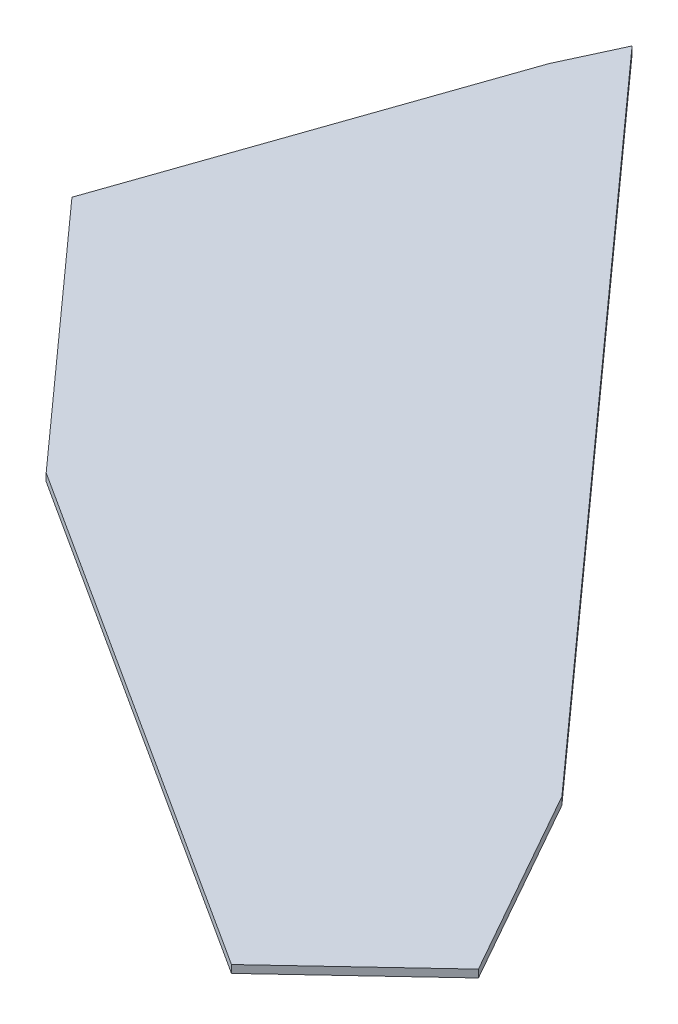
ISO-10303-21;
HEADER;
FILE_DESCRIPTION(('STEP AP214'),'2;1');
FILE_NAME('part.step','',(''),(''),'','','');
FILE_SCHEMA(('AUTOMOTIVE_DESIGN { 1 0 10303 214 1 1 1 1 }'));
ENDSEC;
DATA;
#1=APPLICATION_CONTEXT('core data for automotive mechanical design processes');
#2=APPLICATION_PROTOCOL_DEFINITION('international standard','automotive_design',2000,#1);
#3=PRODUCT_CONTEXT('',#1,'mechanical');
#4=PRODUCT('Part','Part','',(#3));
#5=PRODUCT_RELATED_PRODUCT_CATEGORY('part','',(#4));
#6=PRODUCT_DEFINITION_FORMATION('','',#4);
#7=PRODUCT_DEFINITION_CONTEXT('part definition',#1,'design');
#8=PRODUCT_DEFINITION('design','',#6,#7);
#9=PRODUCT_DEFINITION_SHAPE('','',#8);
#10=(LENGTH_UNIT() NAMED_UNIT(*) SI_UNIT(.MILLI.,.METRE.));
#11=(NAMED_UNIT(*) PLANE_ANGLE_UNIT() SI_UNIT($,.RADIAN.));
#12=(NAMED_UNIT(*) SI_UNIT($,.STERADIAN.) SOLID_ANGLE_UNIT());
#13=UNCERTAINTY_MEASURE_WITH_UNIT(LENGTH_MEASURE(1.E-05),#10,'distance_accuracy_value','');
#14=(GEOMETRIC_REPRESENTATION_CONTEXT(3) GLOBAL_UNCERTAINTY_ASSIGNED_CONTEXT((#13)) GLOBAL_UNIT_ASSIGNED_CONTEXT((#10,
#11,#12)) REPRESENTATION_CONTEXT('',''));
#15=CARTESIAN_POINT('',(0.,0.,0.));
#16=DIRECTION('',(0.,0.,1.));
#17=DIRECTION('',(1.,0.,0.));
#18=AXIS2_PLACEMENT_3D('',#15,#16,#17);
#19=CARTESIAN_POINT('',(-20.0213464052609,2.,-172.579626327256));
#20=DIRECTION('',(0.90792566358203,0.,0.419131231727165));
#21=DIRECTION('',(0.419131231727165,0.,-0.90792566358203));
#22=AXIS2_PLACEMENT_3D('',#19,#20,#21);
#23=PLANE('',#22);
#24=DIRECTION('',(-0.419131231727165,0.,0.90792566358203));
#25=VECTOR('',#24,1.);
#26=CARTESIAN_POINT('',(-20.0213464052609,0.,-172.579626327256));
#27=LINE('',#26,#25);
#28=CARTESIAN_POINT('',(-20.0213464052609,0.,-172.579626327256));
#29=VERTEX_POINT('',#28);
#30=CARTESIAN_POINT('',(-26.8480833342277,0.,-157.791490327964));
#31=VERTEX_POINT('',#30);
#32=EDGE_CURVE('E140',#29,#31,#27,.T.);
#33=ORIENTED_EDGE('',*,*,#32,.T.);
#34=DIRECTION('',(0.,-1.,0.));
#35=VECTOR('',#34,1.);
#36=CARTESIAN_POINT('',(-26.8480833342277,2.,-157.791490327964));
#37=LINE('',#36,#35);
#38=CARTESIAN_POINT('',(-26.8480833342277,2.,-157.791490327964));
#39=VERTEX_POINT('',#38);
#40=EDGE_CURVE('E11',#39,#31,#37,.T.);
#41=ORIENTED_EDGE('',*,*,#40,.F.);
#42=DIRECTION('',(-0.419131231727165,0.,0.90792566358203));
#43=VECTOR('',#42,1.);
#44=CARTESIAN_POINT('',(-20.0213464052609,2.,-172.579626327256));
#45=LINE('',#44,#43);
#46=CARTESIAN_POINT('',(-20.0213464052609,2.,-172.579626327256));
#47=VERTEX_POINT('',#46);
#48=EDGE_CURVE('E162',#47,#39,#45,.T.);
#49=ORIENTED_EDGE('',*,*,#48,.F.);
#50=DIRECTION('',(0.,-1.,0.));
#51=VECTOR('',#50,1.);
#52=CARTESIAN_POINT('',(-20.0213464052609,2.,-172.579626327256));
#53=LINE('',#52,#51);
#54=EDGE_CURVE('E136',#47,#29,#53,.T.);
#55=ORIENTED_EDGE('',*,*,#54,.T.);
#56=EDGE_LOOP('',(#33,#41,#49,#55));
#57=FACE_BOUND('',#56,.T.);
#58=ADVANCED_FACE('F39',(#57),#23,.F.);
#59=CARTESIAN_POINT('',(-26.8480833342277,2.,-157.791490327964));
#60=DIRECTION('',(0.944859691776277,0.,0.327475438554463));
#61=DIRECTION('',(0.327475438554463,0.,-0.944859691776277));
#62=AXIS2_PLACEMENT_3D('',#59,#60,#61);
#63=PLANE('',#62);
#64=DIRECTION('',(-0.327475438554463,0.,0.944859691776277));
#65=VECTOR('',#64,1.);
#66=CARTESIAN_POINT('',(-26.8480833342277,0.,-157.791490327964));
#67=LINE('',#66,#65);
#68=CARTESIAN_POINT('',(-58.8222032614266,0.,-65.5370689503242));
#69=VERTEX_POINT('',#68);
#70=EDGE_CURVE('E144',#31,#69,#67,.T.);
#71=ORIENTED_EDGE('',*,*,#70,.T.);
#72=DIRECTION('',(0.,-1.,0.));
#73=VECTOR('',#72,1.);
#74=CARTESIAN_POINT('',(-58.8222032614266,2.,-65.5370689503242));
#75=LINE('',#74,#73);
#76=CARTESIAN_POINT('',(-58.8222032614266,2.,-65.5370689503242));
#77=VERTEX_POINT('',#76);
#78=EDGE_CURVE('E48',#77,#69,#75,.T.);
#79=ORIENTED_EDGE('',*,*,#78,.F.);
#80=DIRECTION('',(-0.327475438554463,0.,0.944859691776277));
#81=VECTOR('',#80,1.);
#82=CARTESIAN_POINT('',(-26.8480833342277,2.,-157.791490327964));
#83=LINE('',#82,#81);
#84=EDGE_CURVE('E99',#39,#77,#83,.T.);
#85=ORIENTED_EDGE('',*,*,#84,.F.);
#86=ORIENTED_EDGE('',*,*,#40,.T.);
#87=EDGE_LOOP('',(#71,#79,#85,#86));
#88=FACE_BOUND('',#87,.T.);
#89=ADVANCED_FACE('F208',(#88),#63,.F.);
#90=CARTESIAN_POINT('',(-58.8222032614266,2.,-65.5370689503242));
#91=DIRECTION('',(0.744203419196436,0.,-0.667953045397903));
#92=DIRECTION('',(-0.667953045397903,0.,-0.744203419196436));
#93=AXIS2_PLACEMENT_3D('',#90,#91,#92);
#94=PLANE('',#93);
#95=DIRECTION('',(0.667953045397903,0.,0.744203419196436));
#96=VECTOR('',#95,1.);
#97=CARTESIAN_POINT('',(-58.8222032614266,0.,-65.5370689503242));
#98=LINE('',#97,#96);
#99=CARTESIAN_POINT('',(0.,0.,0.));
#100=VERTEX_POINT('',#99);
#101=EDGE_CURVE('E147',#69,#100,#98,.T.);
#102=ORIENTED_EDGE('',*,*,#101,.T.);
#103=DIRECTION('',(0.,-1.,0.));
#104=VECTOR('',#103,1.);
#105=CARTESIAN_POINT('',(0.,2.,0.));
#106=LINE('',#105,#104);
#107=CARTESIAN_POINT('',(0.,2.,0.));
#108=VERTEX_POINT('',#107);
#109=EDGE_CURVE('E173',#108,#100,#106,.T.);
#110=ORIENTED_EDGE('',*,*,#109,.F.);
#111=DIRECTION('',(0.667953045397903,0.,0.744203419196436));
#112=VECTOR('',#111,1.);
#113=CARTESIAN_POINT('',(-58.8222032614266,2.,-65.5370689503242));
#114=LINE('',#113,#112);
#115=EDGE_CURVE('E183',#77,#108,#114,.T.);
#116=ORIENTED_EDGE('',*,*,#115,.F.);
#117=ORIENTED_EDGE('',*,*,#78,.T.);
#118=EDGE_LOOP('',(#102,#110,#116,#117));
#119=FACE_BOUND('',#118,.T.);
#120=ADVANCED_FACE('F181',(#119),#94,.F.);
#121=CARTESIAN_POINT('',(0.,2.,0.));
#122=DIRECTION('',(0.540597226723028,0.,-0.841281545298226));
#123=DIRECTION('',(-0.841281545298226,0.,-0.540597226723028));
#124=AXIS2_PLACEMENT_3D('',#121,#122,#123);
#125=PLANE('',#124);
#126=DIRECTION('',(0.841281545298226,0.,0.540597226723028));
#127=VECTOR('',#126,1.);
#128=CARTESIAN_POINT('',(0.,0.,0.));
#129=LINE('',#128,#127);
#130=CARTESIAN_POINT('',(135.077099652426,0.,86.7988913747134));
#131=VERTEX_POINT('',#130);
#132=EDGE_CURVE('E150',#100,#131,#129,.T.);
#133=ORIENTED_EDGE('',*,*,#132,.T.);
#134=DIRECTION('',(0.,-1.,0.));
#135=VECTOR('',#134,1.);
#136=CARTESIAN_POINT('',(135.077099652426,2.,86.7988913747134));
#137=LINE('',#136,#135);
#138=CARTESIAN_POINT('',(135.077099652426,2.,86.7988913747134));
#139=VERTEX_POINT('',#138);
#140=EDGE_CURVE('E169',#139,#131,#137,.T.);
#141=ORIENTED_EDGE('',*,*,#140,.F.);
#142=DIRECTION('',(0.841281545298226,0.,0.540597226723028));
#143=VECTOR('',#142,1.);
#144=CARTESIAN_POINT('',(0.,2.,0.));
#145=LINE('',#144,#143);
#146=EDGE_CURVE('E196',#108,#139,#145,.T.);
#147=ORIENTED_EDGE('',*,*,#146,.F.);
#148=ORIENTED_EDGE('',*,*,#109,.T.);
#149=EDGE_LOOP('',(#133,#141,#147,#148));
#150=FACE_BOUND('',#149,.T.);
#151=ADVANCED_FACE('F191',(#150),#125,.F.);
#152=CARTESIAN_POINT('',(135.077099652426,2.,86.7988913747134));
#153=DIRECTION('',(-0.683855826593794,0.,-0.729617165665473));
#154=DIRECTION('',(-0.729617165665473,0.,0.683855826593794));
#155=AXIS2_PLACEMENT_3D('',#152,#153,#154);
#156=PLANE('',#155);
#157=DIRECTION('',(0.729617165665473,0.,-0.683855826593794));
#158=VECTOR('',#157,1.);
#159=CARTESIAN_POINT('',(135.077099652426,0.,86.7988913747134));
#160=LINE('',#159,#158);
#161=CARTESIAN_POINT('',(168.284361453358,0.,55.6743776756967));
#162=VERTEX_POINT('',#161);
#163=EDGE_CURVE('E153',#131,#162,#160,.T.);
#164=ORIENTED_EDGE('',*,*,#163,.T.);
#165=DIRECTION('',(0.,-1.,0.));
#166=VECTOR('',#165,1.);
#167=CARTESIAN_POINT('',(168.284361453358,2.,55.6743776756967));
#168=LINE('',#167,#166);
#169=CARTESIAN_POINT('',(168.284361453358,2.,55.6743776756967));
#170=VERTEX_POINT('',#169);
#171=EDGE_CURVE('E129',#170,#162,#168,.T.);
#172=ORIENTED_EDGE('',*,*,#171,.F.);
#173=DIRECTION('',(0.729617165665473,0.,-0.683855826593794));
#174=VECTOR('',#173,1.);
#175=CARTESIAN_POINT('',(135.077099652426,2.,86.7988913747134));
#176=LINE('',#175,#174);
#177=EDGE_CURVE('E118',#139,#170,#176,.T.);
#178=ORIENTED_EDGE('',*,*,#177,.F.);
#179=ORIENTED_EDGE('',*,*,#140,.T.);
#180=EDGE_LOOP('',(#164,#172,#178,#179));
#181=FACE_BOUND('',#180,.T.);
#182=ADVANCED_FACE('F194',(#181),#156,.F.);
#183=CARTESIAN_POINT('',(168.284361453358,2.,55.6743776756967));
#184=DIRECTION('',(-0.871229546829923,0.,0.490875826182679));
#185=DIRECTION('',(0.490875826182679,0.,0.871229546829922));
#186=AXIS2_PLACEMENT_3D('',#183,#184,#185);
#187=PLANE('',#186);
#188=DIRECTION('',(-0.490875826182679,0.,-0.871229546829923));
#189=VECTOR('',#188,1.);
#190=CARTESIAN_POINT('',(168.284361453358,0.,55.6743776756967));
#191=LINE('',#190,#189);
#192=CARTESIAN_POINT('',(140.224514958185,0.,5.8724399102601));
#193=VERTEX_POINT('',#192);
#194=EDGE_CURVE('E127',#162,#193,#191,.T.);
#195=ORIENTED_EDGE('',*,*,#194,.T.);
#196=DIRECTION('',(0.,-1.,0.));
#197=VECTOR('',#196,1.);
#198=CARTESIAN_POINT('',(140.224514958185,2.,5.8724399102601));
#199=LINE('',#198,#197);
#200=CARTESIAN_POINT('',(140.224514958185,2.,5.8724399102601));
#201=VERTEX_POINT('',#200);
#202=EDGE_CURVE('E124',#201,#193,#199,.T.);
#203=ORIENTED_EDGE('',*,*,#202,.F.);
#204=DIRECTION('',(-0.490875826182679,0.,-0.871229546829923));
#205=VECTOR('',#204,1.);
#206=CARTESIAN_POINT('',(168.284361453358,2.,55.6743776756967));
#207=LINE('',#206,#205);
#208=EDGE_CURVE('E112',#170,#201,#207,.T.);
#209=ORIENTED_EDGE('',*,*,#208,.F.);
#210=ORIENTED_EDGE('',*,*,#171,.T.);
#211=EDGE_LOOP('',(#195,#203,#209,#210));
#212=FACE_BOUND('',#211,.T.);
#213=ADVANCED_FACE('F125',(#212),#187,.F.);
#214=CARTESIAN_POINT('',(140.224514958185,2.,5.8724399102601));
#215=DIRECTION('',(-0.744203419196439,0.,0.6679530453979));
#216=DIRECTION('',(0.6679530453979,0.,0.744203419196439));
#217=AXIS2_PLACEMENT_3D('',#214,#215,#216);
#218=PLANE('',#217);
#219=DIRECTION('',(-0.6679530453979,0.,-0.744203419196439));
#220=VECTOR('',#219,1.);
#221=CARTESIAN_POINT('',(140.224514958185,0.,5.8724399102601));
#222=LINE('',#221,#220);
#223=CARTESIAN_POINT('',(-19.4443860432869,0.,-172.023510835571));
#224=VERTEX_POINT('',#223);
#225=EDGE_CURVE('E85',#193,#224,#222,.T.);
#226=ORIENTED_EDGE('',*,*,#225,.T.);
#227=DIRECTION('',(0.,-1.,0.));
#228=VECTOR('',#227,1.);
#229=CARTESIAN_POINT('',(-19.4443860432869,2.,-172.023510835571));
#230=LINE('',#229,#228);
#231=CARTESIAN_POINT('',(-19.4443860432869,2.,-172.023510835571));
#232=VERTEX_POINT('',#231);
#233=EDGE_CURVE('E130',#232,#224,#230,.T.);
#234=ORIENTED_EDGE('',*,*,#233,.F.);
#235=DIRECTION('',(-0.6679530453979,0.,-0.744203419196439));
#236=VECTOR('',#235,1.);
#237=CARTESIAN_POINT('',(140.224514958185,2.,5.8724399102601));
#238=LINE('',#237,#236);
#239=EDGE_CURVE('E116',#201,#232,#238,.T.);
#240=ORIENTED_EDGE('',*,*,#239,.F.);
#241=ORIENTED_EDGE('',*,*,#202,.T.);
#242=EDGE_LOOP('',(#226,#234,#240,#241));
#243=FACE_BOUND('',#242,.T.);
#244=ADVANCED_FACE('F132',(#243),#218,.F.);
#245=CARTESIAN_POINT('',(-19.4443860432869,2.,-172.023510835571));
#246=DIRECTION('',(-0.693980916120328,0.,0.719993394456359));
#247=DIRECTION('',(0.719993394456359,0.,0.693980916120328));
#248=AXIS2_PLACEMENT_3D('',#245,#246,#247);
#249=PLANE('',#248);
#250=DIRECTION('',(-0.719993394456359,0.,-0.693980916120328));
#251=VECTOR('',#250,1.);
#252=CARTESIAN_POINT('',(-19.4443860432869,0.,-172.023510835571));
#253=LINE('',#252,#251);
#254=EDGE_CURVE('E91',#224,#29,#253,.T.);
#255=ORIENTED_EDGE('',*,*,#254,.T.);
#256=ORIENTED_EDGE('',*,*,#54,.F.);
#257=DIRECTION('',(-0.719993394456359,0.,-0.693980916120328));
#258=VECTOR('',#257,1.);
#259=CARTESIAN_POINT('',(-19.4443860432869,2.,-172.023510835571));
#260=LINE('',#259,#258);
#261=EDGE_CURVE('E56',#232,#47,#260,.T.);
#262=ORIENTED_EDGE('',*,*,#261,.F.);
#263=ORIENTED_EDGE('',*,*,#233,.T.);
#264=EDGE_LOOP('',(#255,#256,#262,#263));
#265=FACE_BOUND('',#264,.T.);
#266=ADVANCED_FACE('F224',(#265),#249,.F.);
#267=CARTESIAN_POINT('',(0.,2.,0.));
#268=DIRECTION('',(0.,1.,0.));
#269=DIRECTION('',(0.,0.,1.));
#270=AXIS2_PLACEMENT_3D('',#267,#268,#269);
#271=PLANE('',#270);
#272=ORIENTED_EDGE('',*,*,#48,.T.);
#273=ORIENTED_EDGE('',*,*,#84,.T.);
#274=ORIENTED_EDGE('',*,*,#115,.T.);
#275=ORIENTED_EDGE('',*,*,#146,.T.);
#276=ORIENTED_EDGE('',*,*,#177,.T.);
#277=ORIENTED_EDGE('',*,*,#208,.T.);
#278=ORIENTED_EDGE('',*,*,#239,.T.);
#279=ORIENTED_EDGE('',*,*,#261,.T.);
#280=EDGE_LOOP('',(#272,#273,#274,#275,#276,#277,#278,#279));
#281=FACE_BOUND('',#280,.T.);
#282=ADVANCED_FACE('F114',(#281),#271,.T.);
#283=CARTESIAN_POINT('',(0.,0.,0.));
#284=DIRECTION('',(0.,1.,0.));
#285=DIRECTION('',(0.,0.,1.));
#286=AXIS2_PLACEMENT_3D('',#283,#284,#285);
#287=PLANE('',#286);
#288=ORIENTED_EDGE('',*,*,#32,.F.);
#289=ORIENTED_EDGE('',*,*,#254,.F.);
#290=ORIENTED_EDGE('',*,*,#225,.F.);
#291=ORIENTED_EDGE('',*,*,#194,.F.);
#292=ORIENTED_EDGE('',*,*,#163,.F.);
#293=ORIENTED_EDGE('',*,*,#132,.F.);
#294=ORIENTED_EDGE('',*,*,#101,.F.);
#295=ORIENTED_EDGE('',*,*,#70,.F.);
#296=EDGE_LOOP('',(#288,#289,#290,#291,#292,#293,#294,#295));
#297=FACE_BOUND('',#296,.T.);
#298=ADVANCED_FACE('F187',(#297),#287,.F.);
#299=CLOSED_SHELL('',(#58,#89,#120,#151,#182,#213,#244,#266,#282,#298));
#300=MANIFOLD_SOLID_BREP('B2',#299);
#301=ADVANCED_BREP_SHAPE_REPRESENTATION('',(#18,#300),#14);
#302=SHAPE_DEFINITION_REPRESENTATION(#9,#301);
ENDSEC;
END-ISO-10303-21;
